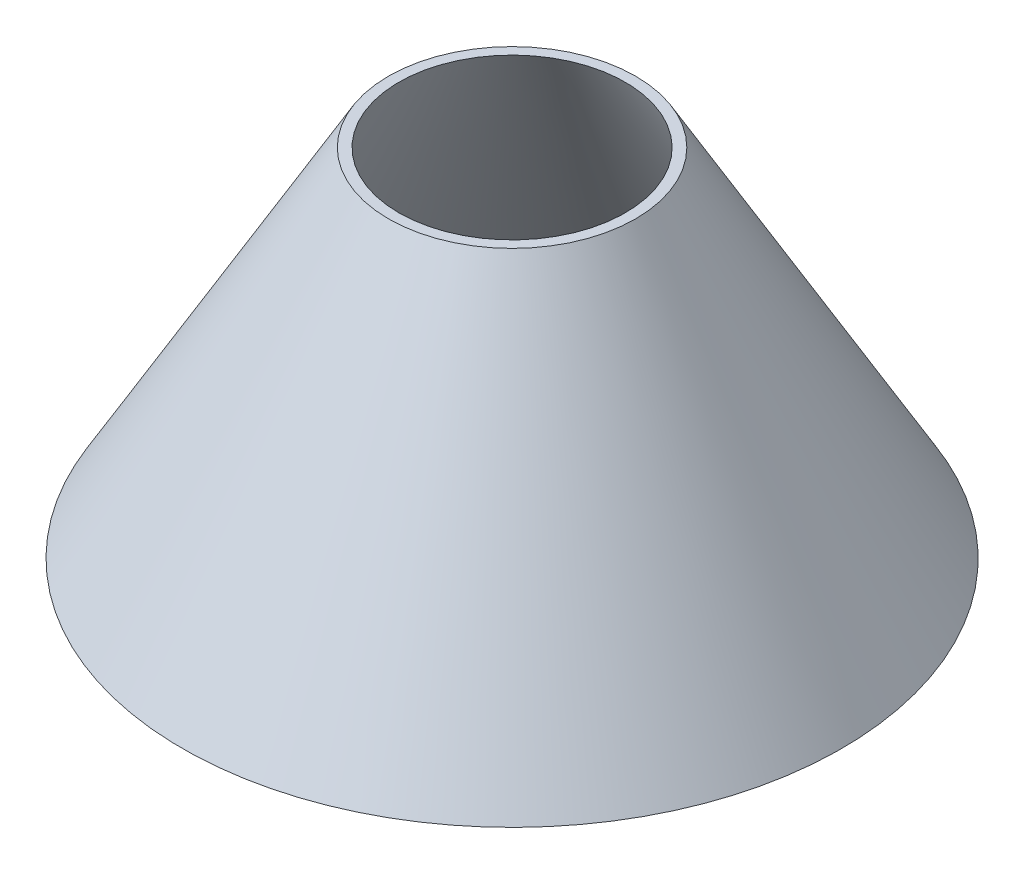
ISO-10303-21;
HEADER;
FILE_DESCRIPTION(('STEP AP214'),'2;1');
FILE_NAME('part.step','',(''),(''),'','','');
FILE_SCHEMA(('AUTOMOTIVE_DESIGN { 1 0 10303 214 1 1 1 1 }'));
ENDSEC;
DATA;
#1=APPLICATION_CONTEXT('core data for automotive mechanical design processes');
#2=APPLICATION_PROTOCOL_DEFINITION('international standard','automotive_design',2000,#1);
#3=PRODUCT_CONTEXT('',#1,'mechanical');
#4=PRODUCT('Part','Part','',(#3));
#5=PRODUCT_RELATED_PRODUCT_CATEGORY('part','',(#4));
#6=PRODUCT_DEFINITION_FORMATION('','',#4);
#7=PRODUCT_DEFINITION_CONTEXT('part definition',#1,'design');
#8=PRODUCT_DEFINITION('design','',#6,#7);
#9=PRODUCT_DEFINITION_SHAPE('','',#8);
#10=(LENGTH_UNIT() NAMED_UNIT(*) SI_UNIT(.MILLI.,.METRE.));
#11=(NAMED_UNIT(*) PLANE_ANGLE_UNIT() SI_UNIT($,.RADIAN.));
#12=(NAMED_UNIT(*) SI_UNIT($,.STERADIAN.) SOLID_ANGLE_UNIT());
#13=UNCERTAINTY_MEASURE_WITH_UNIT(LENGTH_MEASURE(1.E-05),#10,'distance_accuracy_value','');
#14=(GEOMETRIC_REPRESENTATION_CONTEXT(3) GLOBAL_UNCERTAINTY_ASSIGNED_CONTEXT((#13)) GLOBAL_UNIT_ASSIGNED_CONTEXT((#10,
#11,#12)) REPRESENTATION_CONTEXT('',''));
#15=CARTESIAN_POINT('',(0.,0.,0.));
#16=DIRECTION('',(0.,0.,1.));
#17=DIRECTION('',(1.,0.,0.));
#18=AXIS2_PLACEMENT_3D('',#15,#16,#17);
#19=CARTESIAN_POINT('',(0.,0.,0.));
#20=DIRECTION('',(0.,1.,0.));
#21=DIRECTION('',(0.,0.,1.));
#22=AXIS2_PLACEMENT_3D('',#19,#20,#21);
#23=PLANE('',#22);
#24=CARTESIAN_POINT('',(0.,0.,0.));
#25=DIRECTION('',(0.,1.,0.));
#26=DIRECTION('',(0.,0.,1.));
#27=AXIS2_PLACEMENT_3D('',#24,#25,#26);
#28=CIRCLE('',#27,42.6134001010463);
#29=CARTESIAN_POINT('',(0.,0.,42.6134001010463));
#30=VERTEX_POINT('',#29);
#31=EDGE_CURVE('E62',#30,#30,#28,.F.);
#32=ORIENTED_EDGE('',*,*,#31,.F.);
#33=EDGE_LOOP('',(#32));
#34=FACE_BOUND('',#33,.T.);
#35=CARTESIAN_POINT('',(0.,0.,0.));
#36=DIRECTION('',(0.,-1.,0.));
#37=DIRECTION('',(0.,0.,-1.));
#38=AXIS2_PLACEMENT_3D('',#35,#36,#37);
#39=CIRCLE('',#38,44.);
#40=CARTESIAN_POINT('',(0.,0.,-44.));
#41=VERTEX_POINT('',#40);
#42=EDGE_CURVE('E52',#41,#41,#39,.T.);
#43=ORIENTED_EDGE('',*,*,#42,.T.);
#44=EDGE_LOOP('',(#43));
#45=FACE_BOUND('',#44,.T.);
#46=ADVANCED_FACE('F45',(#34,#45),#23,.F.);
#47=CARTESIAN_POINT('',(0.,47.5,0.));
#48=DIRECTION('',(0.,1.,0.));
#49=DIRECTION('',(0.,0.,1.));
#50=AXIS2_PLACEMENT_3D('',#47,#48,#49);
#51=PLANE('',#50);
#52=CARTESIAN_POINT('',(0.,47.5,0.));
#53=DIRECTION('',(0.,1.,0.));
#54=DIRECTION('',(0.,0.,1.));
#55=AXIS2_PLACEMENT_3D('',#52,#53,#54);
#56=CIRCLE('',#55,15.1134001010463);
#57=CARTESIAN_POINT('',(0.,47.5,15.1134001010463));
#58=VERTEX_POINT('',#57);
#59=EDGE_CURVE('E57',#58,#58,#56,.F.);
#60=ORIENTED_EDGE('',*,*,#59,.T.);
#61=EDGE_LOOP('',(#60));
#62=FACE_BOUND('',#61,.T.);
#63=CARTESIAN_POINT('',(0.,47.5,0.));
#64=DIRECTION('',(0.,-1.,0.));
#65=DIRECTION('',(0.,0.,-1.));
#66=AXIS2_PLACEMENT_3D('',#63,#64,#65);
#67=CIRCLE('',#66,16.5);
#68=CARTESIAN_POINT('',(0.,47.5,-16.5));
#69=VERTEX_POINT('',#68);
#70=EDGE_CURVE('E10',#69,#69,#67,.T.);
#71=ORIENTED_EDGE('',*,*,#70,.F.);
#72=EDGE_LOOP('',(#71));
#73=FACE_BOUND('',#72,.T.);
#74=ADVANCED_FACE('F73',(#62,#73),#51,.T.);
#75=CARTESIAN_POINT('',(0.,47.5,0.));
#76=DIRECTION('',(0.,-1.,0.));
#77=DIRECTION('',(0.,0.,-1.));
#78=AXIS2_PLACEMENT_3D('',#75,#76,#77);
#79=CONICAL_SURFACE('',#78,16.5,0.524795771650107);
#80=ORIENTED_EDGE('',*,*,#42,.F.);
#81=EDGE_LOOP('',(#80));
#82=FACE_BOUND('',#81,.T.);
#83=ORIENTED_EDGE('',*,*,#70,.T.);
#84=EDGE_LOOP('',(#83));
#85=FACE_BOUND('',#84,.T.);
#86=ADVANCED_FACE('F77',(#82,#85),#79,.T.);
#87=CARTESIAN_POINT('',(0.,46.89875647535,0.));
#88=DIRECTION('',(0.,-1.,0.));
#89=DIRECTION('',(0.,0.,-1.));
#90=AXIS2_PLACEMENT_3D('',#87,#88,#89);
#91=CONICAL_SURFACE('',#90,15.4614884574226,0.524795771650107);
#92=ORIENTED_EDGE('',*,*,#31,.T.);
#93=EDGE_LOOP('',(#92));
#94=FACE_BOUND('',#93,.T.);
#95=ORIENTED_EDGE('',*,*,#59,.F.);
#96=EDGE_LOOP('',(#95));
#97=FACE_BOUND('',#96,.T.);
#98=ADVANCED_FACE('F69',(#94,#97),#91,.F.);
#99=CLOSED_SHELL('',(#46,#74,#86,#98));
#100=MANIFOLD_SOLID_BREP('B2',#99);
#101=ADVANCED_BREP_SHAPE_REPRESENTATION('',(#18,#100),#14);
#102=SHAPE_DEFINITION_REPRESENTATION(#9,#101);
ENDSEC;
END-ISO-10303-21;
